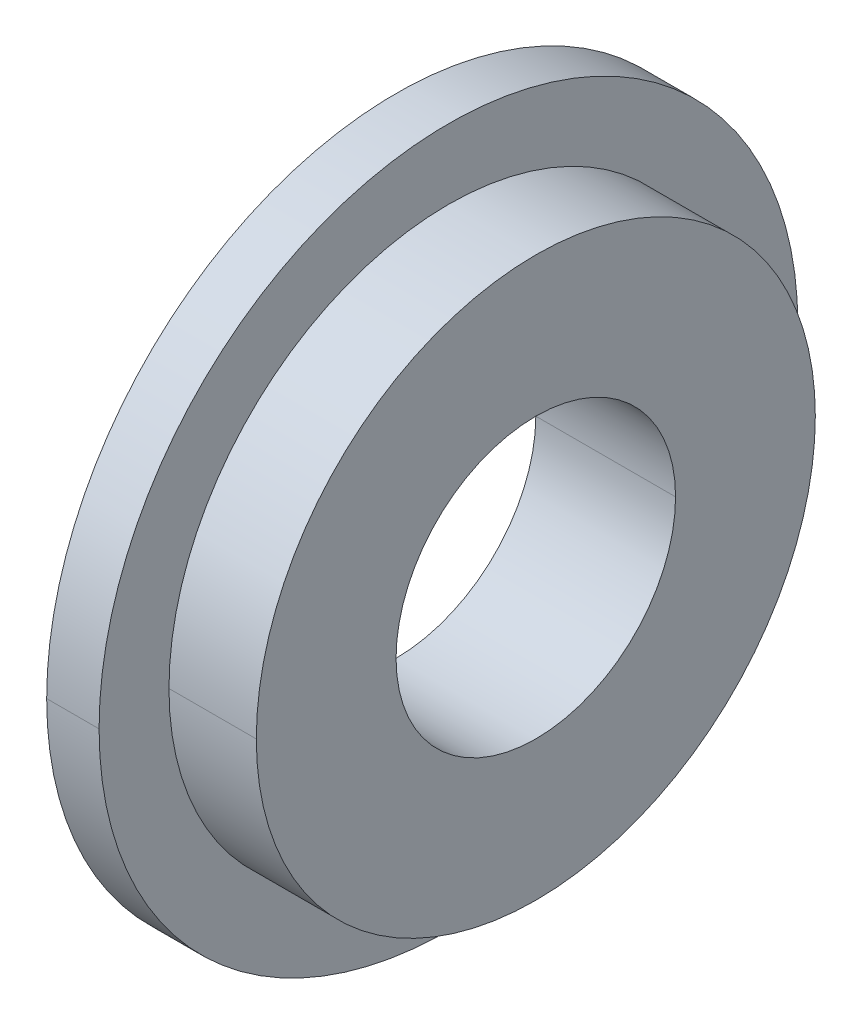
ISO-10303-21;
HEADER;
FILE_DESCRIPTION(('STEP AP214'),'2;1');
FILE_NAME('part.step','',(''),(''),'','','');
FILE_SCHEMA(('AUTOMOTIVE_DESIGN { 1 0 10303 214 1 1 1 1 }'));
ENDSEC;
DATA;
#1=APPLICATION_CONTEXT('core data for automotive mechanical design processes');
#2=APPLICATION_PROTOCOL_DEFINITION('international standard','automotive_design',2000,#1);
#3=PRODUCT_CONTEXT('',#1,'mechanical');
#4=PRODUCT('Part','Part','',(#3));
#5=PRODUCT_RELATED_PRODUCT_CATEGORY('part','',(#4));
#6=PRODUCT_DEFINITION_FORMATION('','',#4);
#7=PRODUCT_DEFINITION_CONTEXT('part definition',#1,'design');
#8=PRODUCT_DEFINITION('design','',#6,#7);
#9=PRODUCT_DEFINITION_SHAPE('','',#8);
#10=(LENGTH_UNIT() NAMED_UNIT(*) SI_UNIT(.MILLI.,.METRE.));
#11=(NAMED_UNIT(*) PLANE_ANGLE_UNIT() SI_UNIT($,.RADIAN.));
#12=(NAMED_UNIT(*) SI_UNIT($,.STERADIAN.) SOLID_ANGLE_UNIT());
#13=UNCERTAINTY_MEASURE_WITH_UNIT(LENGTH_MEASURE(1.E-05),#10,'distance_accuracy_value','');
#14=(GEOMETRIC_REPRESENTATION_CONTEXT(3) GLOBAL_UNCERTAINTY_ASSIGNED_CONTEXT((#13)) GLOBAL_UNIT_ASSIGNED_CONTEXT((#10,
#11,#12)) REPRESENTATION_CONTEXT('',''));
#15=CARTESIAN_POINT('',(0.,0.,0.));
#16=DIRECTION('',(0.,0.,1.));
#17=DIRECTION('',(1.,0.,0.));
#18=AXIS2_PLACEMENT_3D('',#15,#16,#17);
#19=CARTESIAN_POINT('',(0.,10.,0.));
#20=DIRECTION('',(-1.,0.,0.));
#21=DIRECTION('',(0.,0.,1.));
#22=AXIS2_PLACEMENT_3D('',#19,#20,#21);
#23=PLANE('',#22);
#24=CARTESIAN_POINT('',(0.,0.,0.));
#25=DIRECTION('',(1.,0.,0.));
#26=DIRECTION('',(0.,0.,-1.));
#27=AXIS2_PLACEMENT_3D('',#24,#25,#26);
#28=CIRCLE('',#27,4.);
#29=CARTESIAN_POINT('',(0.,0.,-4.));
#30=VERTEX_POINT('',#29);
#31=CARTESIAN_POINT('',(0.,0.,4.));
#32=VERTEX_POINT('',#31);
#33=EDGE_CURVE('E10',#30,#32,#28,.T.);
#34=ORIENTED_EDGE('',*,*,#33,.T.);
#35=CARTESIAN_POINT('',(0.,0.,0.));
#36=DIRECTION('',(1.,0.,0.));
#37=DIRECTION('',(0.,0.,-1.));
#38=AXIS2_PLACEMENT_3D('',#35,#36,#37);
#39=CIRCLE('',#38,4.);
#40=EDGE_CURVE('E24',#32,#30,#39,.T.);
#41=ORIENTED_EDGE('',*,*,#40,.T.);
#42=EDGE_LOOP('',(#34,#41));
#43=FACE_BOUND('',#42,.T.);
#44=CARTESIAN_POINT('',(0.,0.,0.));
#45=DIRECTION('',(1.,0.,0.));
#46=DIRECTION('',(0.,0.,-1.));
#47=AXIS2_PLACEMENT_3D('',#44,#45,#46);
#48=CIRCLE('',#47,10.);
#49=CARTESIAN_POINT('',(0.,0.,10.));
#50=VERTEX_POINT('',#49);
#51=CARTESIAN_POINT('',(0.,0.,-10.));
#52=VERTEX_POINT('',#51);
#53=EDGE_CURVE('E135',#50,#52,#48,.T.);
#54=ORIENTED_EDGE('',*,*,#53,.F.);
#55=CARTESIAN_POINT('',(0.,0.,0.));
#56=DIRECTION('',(1.,0.,0.));
#57=DIRECTION('',(0.,0.,-1.));
#58=AXIS2_PLACEMENT_3D('',#55,#56,#57);
#59=CIRCLE('',#58,10.);
#60=EDGE_CURVE('E130',#52,#50,#59,.T.);
#61=ORIENTED_EDGE('',*,*,#60,.F.);
#62=EDGE_LOOP('',(#54,#61));
#63=FACE_BOUND('',#62,.T.);
#64=ADVANCED_FACE('F16',(#43,#63),#23,.T.);
#65=CARTESIAN_POINT('',(4.,0.,0.));
#66=DIRECTION('',(1.,0.,0.));
#67=DIRECTION('',(0.,-1.,0.));
#68=AXIS2_PLACEMENT_3D('',#65,#66,#67);
#69=CYLINDRICAL_SURFACE('',#68,10.);
#70=DIRECTION('',(1.,0.,0.));
#71=VECTOR('',#70,1.);
#72=CARTESIAN_POINT('',(0.,0.,10.));
#73=LINE('',#72,#71);
#74=CARTESIAN_POINT('',(1.5,0.,10.));
#75=VERTEX_POINT('',#74);
#76=EDGE_CURVE('E126',#50,#75,#73,.T.);
#77=ORIENTED_EDGE('',*,*,#76,.T.);
#78=CARTESIAN_POINT('',(1.5,0.,0.));
#79=DIRECTION('',(1.,0.,0.));
#80=DIRECTION('',(0.,0.,-1.));
#81=AXIS2_PLACEMENT_3D('',#78,#79,#80);
#82=CIRCLE('',#81,10.);
#83=CARTESIAN_POINT('',(1.5,0.,-10.));
#84=VERTEX_POINT('',#83);
#85=EDGE_CURVE('E121',#84,#75,#82,.T.);
#86=ORIENTED_EDGE('',*,*,#85,.F.);
#87=DIRECTION('',(1.,0.,0.));
#88=VECTOR('',#87,1.);
#89=CARTESIAN_POINT('',(0.,0.,-10.));
#90=LINE('',#89,#88);
#91=EDGE_CURVE('E116',#52,#84,#90,.T.);
#92=ORIENTED_EDGE('',*,*,#91,.F.);
#93=ORIENTED_EDGE('',*,*,#60,.T.);
#94=EDGE_LOOP('',(#77,#86,#92,#93));
#95=FACE_BOUND('',#94,.T.);
#96=ADVANCED_FACE('F151',(#95),#69,.T.);
#97=CARTESIAN_POINT('',(4.,0.,0.));
#98=DIRECTION('',(1.,0.,0.));
#99=DIRECTION('',(0.,1.,0.));
#100=AXIS2_PLACEMENT_3D('',#97,#98,#99);
#101=CYLINDRICAL_SURFACE('',#100,10.);
#102=ORIENTED_EDGE('',*,*,#76,.F.);
#103=ORIENTED_EDGE('',*,*,#53,.T.);
#104=ORIENTED_EDGE('',*,*,#91,.T.);
#105=CARTESIAN_POINT('',(1.5,0.,0.));
#106=DIRECTION('',(1.,0.,0.));
#107=DIRECTION('',(0.,0.,-1.));
#108=AXIS2_PLACEMENT_3D('',#105,#106,#107);
#109=CIRCLE('',#108,10.);
#110=EDGE_CURVE('E111',#75,#84,#109,.T.);
#111=ORIENTED_EDGE('',*,*,#110,.F.);
#112=EDGE_LOOP('',(#102,#103,#104,#111));
#113=FACE_BOUND('',#112,.T.);
#114=ADVANCED_FACE('F146',(#113),#101,.T.);
#115=CARTESIAN_POINT('',(1.5,8.,0.));
#116=DIRECTION('',(1.,0.,0.));
#117=DIRECTION('',(0.,0.,-1.));
#118=AXIS2_PLACEMENT_3D('',#115,#116,#117);
#119=PLANE('',#118);
#120=ORIENTED_EDGE('',*,*,#85,.T.);
#121=ORIENTED_EDGE('',*,*,#110,.T.);
#122=EDGE_LOOP('',(#120,#121));
#123=FACE_BOUND('',#122,.T.);
#124=CARTESIAN_POINT('',(1.5,0.,0.));
#125=DIRECTION('',(1.,0.,0.));
#126=DIRECTION('',(0.,0.,-1.));
#127=AXIS2_PLACEMENT_3D('',#124,#125,#126);
#128=CIRCLE('',#127,8.);
#129=CARTESIAN_POINT('',(1.5,0.,8.));
#130=VERTEX_POINT('',#129);
#131=CARTESIAN_POINT('',(1.5,0.,-8.));
#132=VERTEX_POINT('',#131);
#133=EDGE_CURVE('E106',#130,#132,#128,.T.);
#134=ORIENTED_EDGE('',*,*,#133,.F.);
#135=CARTESIAN_POINT('',(1.5,0.,0.));
#136=DIRECTION('',(1.,0.,0.));
#137=DIRECTION('',(0.,0.,-1.));
#138=AXIS2_PLACEMENT_3D('',#135,#136,#137);
#139=CIRCLE('',#138,8.);
#140=EDGE_CURVE('E101',#132,#130,#139,.T.);
#141=ORIENTED_EDGE('',*,*,#140,.F.);
#142=EDGE_LOOP('',(#134,#141));
#143=FACE_BOUND('',#142,.T.);
#144=ADVANCED_FACE('F153',(#123,#143),#119,.T.);
#145=CARTESIAN_POINT('',(4.,0.,0.));
#146=DIRECTION('',(1.,0.,0.));
#147=DIRECTION('',(0.,-1.,0.));
#148=AXIS2_PLACEMENT_3D('',#145,#146,#147);
#149=CYLINDRICAL_SURFACE('',#148,8.);
#150=DIRECTION('',(1.,0.,0.));
#151=VECTOR('',#150,1.);
#152=CARTESIAN_POINT('',(1.5,0.,8.));
#153=LINE('',#152,#151);
#154=CARTESIAN_POINT('',(4.,0.,8.));
#155=VERTEX_POINT('',#154);
#156=EDGE_CURVE('E97',#130,#155,#153,.T.);
#157=ORIENTED_EDGE('',*,*,#156,.T.);
#158=CARTESIAN_POINT('',(4.,0.,0.));
#159=DIRECTION('',(1.,0.,0.));
#160=DIRECTION('',(0.,0.,-1.));
#161=AXIS2_PLACEMENT_3D('',#158,#159,#160);
#162=CIRCLE('',#161,8.);
#163=CARTESIAN_POINT('',(4.,0.,-8.));
#164=VERTEX_POINT('',#163);
#165=EDGE_CURVE('E92',#164,#155,#162,.T.);
#166=ORIENTED_EDGE('',*,*,#165,.F.);
#167=DIRECTION('',(1.,0.,0.));
#168=VECTOR('',#167,1.);
#169=CARTESIAN_POINT('',(1.5,0.,-8.));
#170=LINE('',#169,#168);
#171=EDGE_CURVE('E81',#132,#164,#170,.T.);
#172=ORIENTED_EDGE('',*,*,#171,.F.);
#173=ORIENTED_EDGE('',*,*,#140,.T.);
#174=EDGE_LOOP('',(#157,#166,#172,#173));
#175=FACE_BOUND('',#174,.T.);
#176=ADVANCED_FACE('F156',(#175),#149,.T.);
#177=CARTESIAN_POINT('',(4.,0.,0.));
#178=DIRECTION('',(1.,0.,0.));
#179=DIRECTION('',(0.,1.,0.));
#180=AXIS2_PLACEMENT_3D('',#177,#178,#179);
#181=CYLINDRICAL_SURFACE('',#180,8.);
#182=ORIENTED_EDGE('',*,*,#156,.F.);
#183=ORIENTED_EDGE('',*,*,#133,.T.);
#184=ORIENTED_EDGE('',*,*,#171,.T.);
#185=CARTESIAN_POINT('',(4.,0.,0.));
#186=DIRECTION('',(1.,0.,0.));
#187=DIRECTION('',(0.,0.,-1.));
#188=AXIS2_PLACEMENT_3D('',#185,#186,#187);
#189=CIRCLE('',#188,8.);
#190=EDGE_CURVE('E78',#155,#164,#189,.T.);
#191=ORIENTED_EDGE('',*,*,#190,.F.);
#192=EDGE_LOOP('',(#182,#183,#184,#191));
#193=FACE_BOUND('',#192,.T.);
#194=ADVANCED_FACE('F162',(#193),#181,.T.);
#195=CARTESIAN_POINT('',(4.,4.,0.));
#196=DIRECTION('',(1.,0.,0.));
#197=DIRECTION('',(0.,0.,-1.));
#198=AXIS2_PLACEMENT_3D('',#195,#196,#197);
#199=PLANE('',#198);
#200=ORIENTED_EDGE('',*,*,#165,.T.);
#201=ORIENTED_EDGE('',*,*,#190,.T.);
#202=EDGE_LOOP('',(#200,#201));
#203=FACE_BOUND('',#202,.T.);
#204=CARTESIAN_POINT('',(4.,0.,0.));
#205=DIRECTION('',(1.,0.,0.));
#206=DIRECTION('',(0.,0.,-1.));
#207=AXIS2_PLACEMENT_3D('',#204,#205,#206);
#208=CIRCLE('',#207,4.);
#209=CARTESIAN_POINT('',(4.,0.,4.));
#210=VERTEX_POINT('',#209);
#211=CARTESIAN_POINT('',(4.,0.,-4.));
#212=VERTEX_POINT('',#211);
#213=EDGE_CURVE('E66',#210,#212,#208,.T.);
#214=ORIENTED_EDGE('',*,*,#213,.F.);
#215=CARTESIAN_POINT('',(4.,0.,0.));
#216=DIRECTION('',(1.,0.,0.));
#217=DIRECTION('',(0.,0.,-1.));
#218=AXIS2_PLACEMENT_3D('',#215,#216,#217);
#219=CIRCLE('',#218,4.);
#220=EDGE_CURVE('E62',#212,#210,#219,.T.);
#221=ORIENTED_EDGE('',*,*,#220,.F.);
#222=EDGE_LOOP('',(#214,#221));
#223=FACE_BOUND('',#222,.T.);
#224=ADVANCED_FACE('F64',(#203,#223),#199,.T.);
#225=CARTESIAN_POINT('',(4.,0.,0.));
#226=DIRECTION('',(1.,0.,0.));
#227=DIRECTION('',(0.,-1.,0.));
#228=AXIS2_PLACEMENT_3D('',#225,#226,#227);
#229=CYLINDRICAL_SURFACE('',#228,4.);
#230=DIRECTION('',(1.,0.,0.));
#231=VECTOR('',#230,1.);
#232=CARTESIAN_POINT('',(0.,0.,4.));
#233=LINE('',#232,#231);
#234=EDGE_CURVE('E70',#32,#210,#233,.T.);
#235=ORIENTED_EDGE('',*,*,#234,.F.);
#236=ORIENTED_EDGE('',*,*,#33,.F.);
#237=DIRECTION('',(1.,0.,0.));
#238=VECTOR('',#237,1.);
#239=CARTESIAN_POINT('',(0.,0.,-4.));
#240=LINE('',#239,#238);
#241=EDGE_CURVE('E73',#30,#212,#240,.T.);
#242=ORIENTED_EDGE('',*,*,#241,.T.);
#243=ORIENTED_EDGE('',*,*,#220,.T.);
#244=EDGE_LOOP('',(#235,#236,#242,#243));
#245=FACE_BOUND('',#244,.T.);
#246=ADVANCED_FACE('F74',(#245),#229,.F.);
#247=CARTESIAN_POINT('',(4.,0.,0.));
#248=DIRECTION('',(1.,0.,0.));
#249=DIRECTION('',(0.,1.,0.));
#250=AXIS2_PLACEMENT_3D('',#247,#248,#249);
#251=CYLINDRICAL_SURFACE('',#250,4.);
#252=ORIENTED_EDGE('',*,*,#234,.T.);
#253=ORIENTED_EDGE('',*,*,#213,.T.);
#254=ORIENTED_EDGE('',*,*,#241,.F.);
#255=ORIENTED_EDGE('',*,*,#40,.F.);
#256=EDGE_LOOP('',(#252,#253,#254,#255));
#257=FACE_BOUND('',#256,.T.);
#258=ADVANCED_FACE('F77',(#257),#251,.F.);
#259=CLOSED_SHELL('',(#64,#96,#114,#144,#176,#194,#224,#246,#258));
#260=MANIFOLD_SOLID_BREP('B1',#259);
#261=ADVANCED_BREP_SHAPE_REPRESENTATION('',(#18,#260),#14);
#262=SHAPE_DEFINITION_REPRESENTATION(#9,#261);
ENDSEC;
END-ISO-10303-21;
